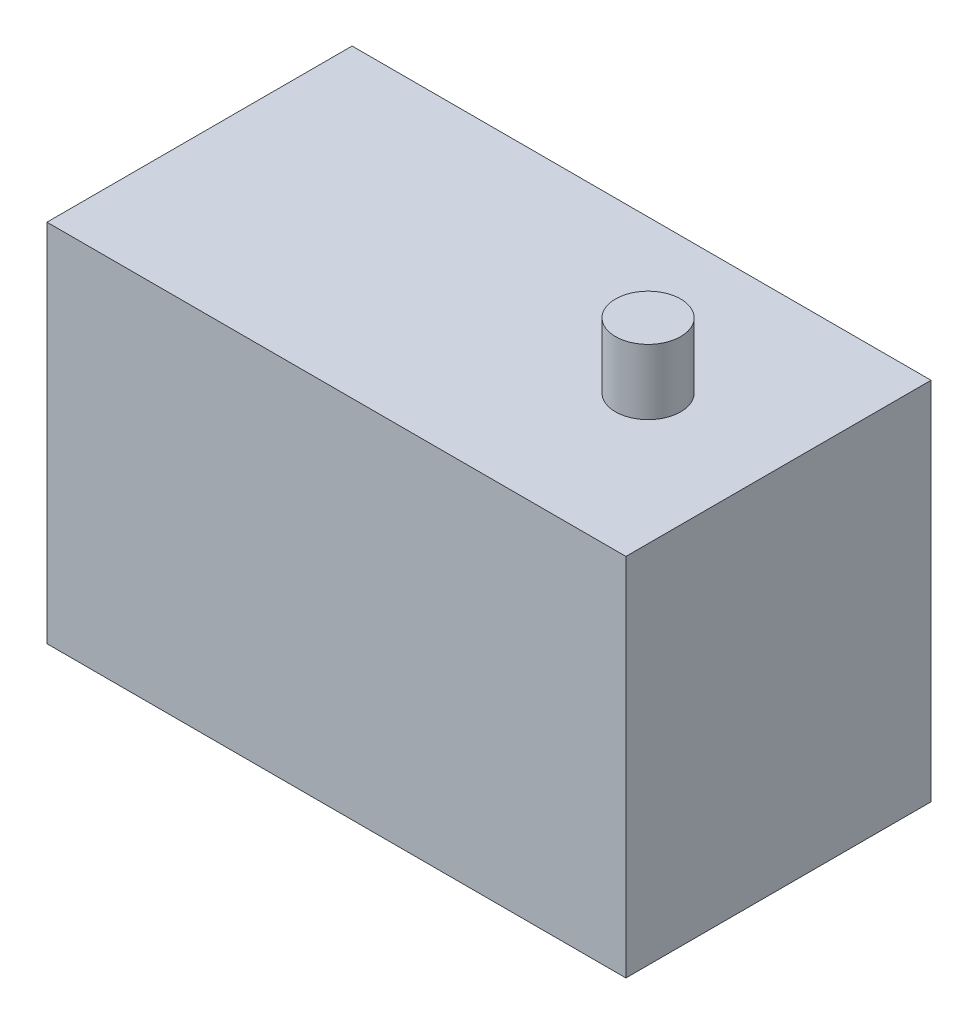
ISO-10303-21;
HEADER;
FILE_DESCRIPTION(('STEP AP214'),'2;1');
FILE_NAME('part.step','',(''),(''),'','','');
FILE_SCHEMA(('AUTOMOTIVE_DESIGN { 1 0 10303 214 1 1 1 1 }'));
ENDSEC;
DATA;
#1=APPLICATION_CONTEXT('core data for automotive mechanical design processes');
#2=APPLICATION_PROTOCOL_DEFINITION('international standard','automotive_design',2000,#1);
#3=PRODUCT_CONTEXT('',#1,'mechanical');
#4=PRODUCT('Part','Part','',(#3));
#5=PRODUCT_RELATED_PRODUCT_CATEGORY('part','',(#4));
#6=PRODUCT_DEFINITION_FORMATION('','',#4);
#7=PRODUCT_DEFINITION_CONTEXT('part definition',#1,'design');
#8=PRODUCT_DEFINITION('design','',#6,#7);
#9=PRODUCT_DEFINITION_SHAPE('','',#8);
#10=(LENGTH_UNIT() NAMED_UNIT(*) SI_UNIT(.MILLI.,.METRE.));
#11=(NAMED_UNIT(*) PLANE_ANGLE_UNIT() SI_UNIT($,.RADIAN.));
#12=(NAMED_UNIT(*) SI_UNIT($,.STERADIAN.) SOLID_ANGLE_UNIT());
#13=UNCERTAINTY_MEASURE_WITH_UNIT(LENGTH_MEASURE(1.E-05),#10,'distance_accuracy_value','');
#14=(GEOMETRIC_REPRESENTATION_CONTEXT(3) GLOBAL_UNCERTAINTY_ASSIGNED_CONTEXT((#13)) GLOBAL_UNIT_ASSIGNED_CONTEXT((#10,
#11,#12)) REPRESENTATION_CONTEXT('',''));
#15=CARTESIAN_POINT('',(0.,0.,0.));
#16=DIRECTION('',(0.,0.,1.));
#17=DIRECTION('',(1.,0.,0.));
#18=AXIS2_PLACEMENT_3D('',#15,#16,#17);
#19=CARTESIAN_POINT('',(-42.1477832512315,28.,-23.1931034482759));
#20=DIRECTION('',(1.,0.,0.));
#21=DIRECTION('',(0.,0.,-1.));
#22=AXIS2_PLACEMENT_3D('',#19,#20,#21);
#23=PLANE('',#22);
#24=DIRECTION('',(0.,0.,1.));
#25=VECTOR('',#24,1.);
#26=CARTESIAN_POINT('',(-42.1477832512315,0.,-23.1931034482759));
#27=LINE('',#26,#25);
#28=CARTESIAN_POINT('',(-42.1477832512315,0.,-23.1931034482759));
#29=VERTEX_POINT('',#28);
#30=CARTESIAN_POINT('',(-42.1477832512315,0.,0.20689655172414));
#31=VERTEX_POINT('',#30);
#32=EDGE_CURVE('E102',#29,#31,#27,.T.);
#33=ORIENTED_EDGE('',*,*,#32,.T.);
#34=DIRECTION('',(0.,-1.,0.));
#35=VECTOR('',#34,1.);
#36=CARTESIAN_POINT('',(-42.1477832512315,28.,0.20689655172414));
#37=LINE('',#36,#35);
#38=CARTESIAN_POINT('',(-42.1477832512315,28.,0.20689655172414));
#39=VERTEX_POINT('',#38);
#40=EDGE_CURVE('E44',#39,#31,#37,.T.);
#41=ORIENTED_EDGE('',*,*,#40,.F.);
#42=DIRECTION('',(0.,0.,1.));
#43=VECTOR('',#42,1.);
#44=CARTESIAN_POINT('',(-42.1477832512315,28.,-23.1931034482759));
#45=LINE('',#44,#43);
#46=CARTESIAN_POINT('',(-42.1477832512315,28.,-23.1931034482759));
#47=VERTEX_POINT('',#46);
#48=EDGE_CURVE('E88',#47,#39,#45,.T.);
#49=ORIENTED_EDGE('',*,*,#48,.F.);
#50=DIRECTION('',(0.,-1.,0.));
#51=VECTOR('',#50,1.);
#52=CARTESIAN_POINT('',(-42.1477832512315,28.,-23.1931034482759));
#53=LINE('',#52,#51);
#54=EDGE_CURVE('E98',#47,#29,#53,.T.);
#55=ORIENTED_EDGE('',*,*,#54,.T.);
#56=EDGE_LOOP('',(#33,#41,#49,#55));
#57=FACE_BOUND('',#56,.T.);
#58=ADVANCED_FACE('F36',(#57),#23,.F.);
#59=CARTESIAN_POINT('',(-42.1477832512315,28.,0.20689655172414));
#60=DIRECTION('',(0.,0.,-1.));
#61=DIRECTION('',(-1.,0.,0.));
#62=AXIS2_PLACEMENT_3D('',#59,#60,#61);
#63=PLANE('',#62);
#64=DIRECTION('',(1.,0.,0.));
#65=VECTOR('',#64,1.);
#66=CARTESIAN_POINT('',(-42.1477832512315,0.,0.20689655172414));
#67=LINE('',#66,#65);
#68=CARTESIAN_POINT('',(2.25221674876847,0.,0.20689655172414));
#69=VERTEX_POINT('',#68);
#70=EDGE_CURVE('E93',#31,#69,#67,.T.);
#71=ORIENTED_EDGE('',*,*,#70,.T.);
#72=DIRECTION('',(0.,-1.,0.));
#73=VECTOR('',#72,1.);
#74=CARTESIAN_POINT('',(2.25221674876847,28.,0.20689655172414));
#75=LINE('',#74,#73);
#76=CARTESIAN_POINT('',(2.25221674876847,28.,0.20689655172414));
#77=VERTEX_POINT('',#76);
#78=EDGE_CURVE('E91',#77,#69,#75,.T.);
#79=ORIENTED_EDGE('',*,*,#78,.F.);
#80=DIRECTION('',(1.,0.,0.));
#81=VECTOR('',#80,1.);
#82=CARTESIAN_POINT('',(-42.1477832512315,28.,0.20689655172414));
#83=LINE('',#82,#81);
#84=EDGE_CURVE('E83',#39,#77,#83,.T.);
#85=ORIENTED_EDGE('',*,*,#84,.F.);
#86=ORIENTED_EDGE('',*,*,#40,.T.);
#87=EDGE_LOOP('',(#71,#79,#85,#86));
#88=FACE_BOUND('',#87,.T.);
#89=ADVANCED_FACE('F92',(#88),#63,.F.);
#90=CARTESIAN_POINT('',(2.25221674876847,28.,-23.1931034482759));
#91=DIRECTION('',(-1.,0.,0.));
#92=DIRECTION('',(0.,0.,1.));
#93=AXIS2_PLACEMENT_3D('',#90,#91,#92);
#94=PLANE('',#93);
#95=DIRECTION('',(0.,0.,-1.));
#96=VECTOR('',#95,1.);
#97=CARTESIAN_POINT('',(2.25221674876847,0.,-23.1931034482759));
#98=LINE('',#97,#96);
#99=CARTESIAN_POINT('',(2.25221674876847,0.,-23.1931034482759));
#100=VERTEX_POINT('',#99);
#101=EDGE_CURVE('E69',#69,#100,#98,.T.);
#102=ORIENTED_EDGE('',*,*,#101,.T.);
#103=DIRECTION('',(0.,-1.,0.));
#104=VECTOR('',#103,1.);
#105=CARTESIAN_POINT('',(2.25221674876847,28.,-23.1931034482759));
#106=LINE('',#105,#104);
#107=CARTESIAN_POINT('',(2.25221674876847,28.,-23.1931034482759));
#108=VERTEX_POINT('',#107);
#109=EDGE_CURVE('E94',#108,#100,#106,.T.);
#110=ORIENTED_EDGE('',*,*,#109,.F.);
#111=DIRECTION('',(0.,0.,-1.));
#112=VECTOR('',#111,1.);
#113=CARTESIAN_POINT('',(2.25221674876847,28.,-23.1931034482759));
#114=LINE('',#113,#112);
#115=EDGE_CURVE('E86',#77,#108,#114,.T.);
#116=ORIENTED_EDGE('',*,*,#115,.F.);
#117=ORIENTED_EDGE('',*,*,#78,.T.);
#118=EDGE_LOOP('',(#102,#110,#116,#117));
#119=FACE_BOUND('',#118,.T.);
#120=ADVANCED_FACE('F96',(#119),#94,.F.);
#121=CARTESIAN_POINT('',(-42.1477832512315,28.,-23.1931034482759));
#122=DIRECTION('',(0.,0.,1.));
#123=DIRECTION('',(1.,0.,0.));
#124=AXIS2_PLACEMENT_3D('',#121,#122,#123);
#125=PLANE('',#124);
#126=DIRECTION('',(-1.,0.,0.));
#127=VECTOR('',#126,1.);
#128=CARTESIAN_POINT('',(-42.1477832512315,0.,-23.1931034482759));
#129=LINE('',#128,#127);
#130=EDGE_CURVE('E75',#100,#29,#129,.T.);
#131=ORIENTED_EDGE('',*,*,#130,.T.);
#132=ORIENTED_EDGE('',*,*,#54,.F.);
#133=DIRECTION('',(-1.,0.,0.));
#134=VECTOR('',#133,1.);
#135=CARTESIAN_POINT('',(-42.1477832512315,28.,-23.1931034482759));
#136=LINE('',#135,#134);
#137=EDGE_CURVE('E52',#108,#47,#136,.T.);
#138=ORIENTED_EDGE('',*,*,#137,.F.);
#139=ORIENTED_EDGE('',*,*,#109,.T.);
#140=EDGE_LOOP('',(#131,#132,#138,#139));
#141=FACE_BOUND('',#140,.T.);
#142=ADVANCED_FACE('F125',(#141),#125,.F.);
#143=CARTESIAN_POINT('',(0.,28.,0.));
#144=DIRECTION('',(0.,1.,0.));
#145=DIRECTION('',(0.,0.,1.));
#146=AXIS2_PLACEMENT_3D('',#143,#144,#145);
#147=PLANE('',#146);
#148=CARTESIAN_POINT('',(-7.74778325123153,28.,-11.4931034482759));
#149=DIRECTION('',(0.,1.,0.));
#150=DIRECTION('',(0.,0.,1.));
#151=AXIS2_PLACEMENT_3D('',#148,#149,#150);
#152=CIRCLE('',#151,2.5);
#153=CARTESIAN_POINT('',(-7.74778325123153,28.,-8.99310344827585));
#154=VERTEX_POINT('',#153);
#155=EDGE_CURVE('E11',#154,#154,#152,.T.);
#156=ORIENTED_EDGE('',*,*,#155,.F.);
#157=EDGE_LOOP('',(#156));
#158=FACE_BOUND('',#157,.T.);
#159=ORIENTED_EDGE('',*,*,#48,.T.);
#160=ORIENTED_EDGE('',*,*,#84,.T.);
#161=ORIENTED_EDGE('',*,*,#115,.T.);
#162=ORIENTED_EDGE('',*,*,#137,.T.);
#163=EDGE_LOOP('',(#159,#160,#161,#162));
#164=FACE_BOUND('',#163,.T.);
#165=ADVANCED_FACE('F84',(#158,#164),#147,.T.);
#166=CARTESIAN_POINT('',(0.,0.,0.));
#167=DIRECTION('',(0.,1.,0.));
#168=DIRECTION('',(0.,0.,1.));
#169=AXIS2_PLACEMENT_3D('',#166,#167,#168);
#170=PLANE('',#169);
#171=CARTESIAN_POINT('',(-7.74778325123153,0.,-11.4931034482759));
#172=DIRECTION('',(0.,1.,0.));
#173=DIRECTION('',(0.,0.,1.));
#174=AXIS2_PLACEMENT_3D('',#171,#172,#173);
#175=CIRCLE('',#174,2.5);
#176=CARTESIAN_POINT('',(-7.74778325123153,0.,-8.99310344827585));
#177=VERTEX_POINT('',#176);
#178=EDGE_CURVE('E183',#177,#177,#175,.T.);
#179=ORIENTED_EDGE('',*,*,#178,.T.);
#180=EDGE_LOOP('',(#179));
#181=FACE_BOUND('',#180,.T.);
#182=ORIENTED_EDGE('',*,*,#32,.F.);
#183=ORIENTED_EDGE('',*,*,#130,.F.);
#184=ORIENTED_EDGE('',*,*,#101,.F.);
#185=ORIENTED_EDGE('',*,*,#70,.F.);
#186=EDGE_LOOP('',(#182,#183,#184,#185));
#187=FACE_BOUND('',#186,.T.);
#188=ADVANCED_FACE('F113',(#181,#187),#170,.F.);
#189=CARTESIAN_POINT('',(-7.74778325123153,-5.,-11.4931034482759));
#190=DIRECTION('',(0.,1.,0.));
#191=DIRECTION('',(0.,0.,1.));
#192=AXIS2_PLACEMENT_3D('',#189,#190,#191);
#193=CYLINDRICAL_SURFACE('',#192,2.5);
#194=CARTESIAN_POINT('',(-7.74778325123153,-5.,-11.4931034482759));
#195=DIRECTION('',(0.,1.,0.));
#196=DIRECTION('',(0.,0.,1.));
#197=AXIS2_PLACEMENT_3D('',#194,#195,#196);
#198=CIRCLE('',#197,2.5);
#199=CARTESIAN_POINT('',(-7.74778325123153,-5.,-8.99310344827585));
#200=VERTEX_POINT('',#199);
#201=EDGE_CURVE('E105',#200,#200,#198,.T.);
#202=ORIENTED_EDGE('',*,*,#201,.T.);
#203=EDGE_LOOP('',(#202));
#204=FACE_BOUND('',#203,.T.);
#205=ORIENTED_EDGE('',*,*,#178,.F.);
#206=EDGE_LOOP('',(#205));
#207=FACE_BOUND('',#206,.T.);
#208=ADVANCED_FACE('F115',(#204,#207),#193,.T.);
#209=CARTESIAN_POINT('',(-7.74778325123153,-5.,-11.4931034482759));
#210=DIRECTION('',(0.,1.,0.));
#211=DIRECTION('',(0.,0.,1.));
#212=AXIS2_PLACEMENT_3D('',#209,#210,#211);
#213=PLANE('',#212);
#214=ORIENTED_EDGE('',*,*,#201,.F.);
#215=EDGE_LOOP('',(#214));
#216=FACE_BOUND('',#215,.T.);
#217=ADVANCED_FACE('F122',(#216),#213,.F.);
#218=CARTESIAN_POINT('',(-7.74778325123153,28.,-11.4931034482759));
#219=DIRECTION('',(0.,1.,0.));
#220=DIRECTION('',(0.,0.,1.));
#221=AXIS2_PLACEMENT_3D('',#218,#219,#220);
#222=CYLINDRICAL_SURFACE('',#221,2.5);
#223=ORIENTED_EDGE('',*,*,#155,.T.);
#224=EDGE_LOOP('',(#223));
#225=FACE_BOUND('',#224,.T.);
#226=CARTESIAN_POINT('',(-7.74778325123153,33.,-11.4931034482759));
#227=DIRECTION('',(0.,1.,0.));
#228=DIRECTION('',(0.,0.,1.));
#229=AXIS2_PLACEMENT_3D('',#226,#227,#228);
#230=CIRCLE('',#229,2.5);
#231=CARTESIAN_POINT('',(-7.74778325123153,33.,-8.99310344827585));
#232=VERTEX_POINT('',#231);
#233=EDGE_CURVE('E185',#232,#232,#230,.T.);
#234=ORIENTED_EDGE('',*,*,#233,.F.);
#235=EDGE_LOOP('',(#234));
#236=FACE_BOUND('',#235,.T.);
#237=ADVANCED_FACE('F158',(#225,#236),#222,.T.);
#238=CARTESIAN_POINT('',(-7.74778325123153,33.,-11.4931034482759));
#239=DIRECTION('',(0.,1.,0.));
#240=DIRECTION('',(0.,0.,1.));
#241=AXIS2_PLACEMENT_3D('',#238,#239,#240);
#242=PLANE('',#241);
#243=ORIENTED_EDGE('',*,*,#233,.T.);
#244=EDGE_LOOP('',(#243));
#245=FACE_BOUND('',#244,.T.);
#246=ADVANCED_FACE('F163',(#245),#242,.T.);
#247=CLOSED_SHELL('',(#58,#89,#120,#142,#165,#188,#208,#217,#237,#246));
#248=MANIFOLD_SOLID_BREP('B2',#247);
#249=ADVANCED_BREP_SHAPE_REPRESENTATION('',(#18,#248),#14);
#250=SHAPE_DEFINITION_REPRESENTATION(#9,#249);
ENDSEC;
END-ISO-10303-21;
